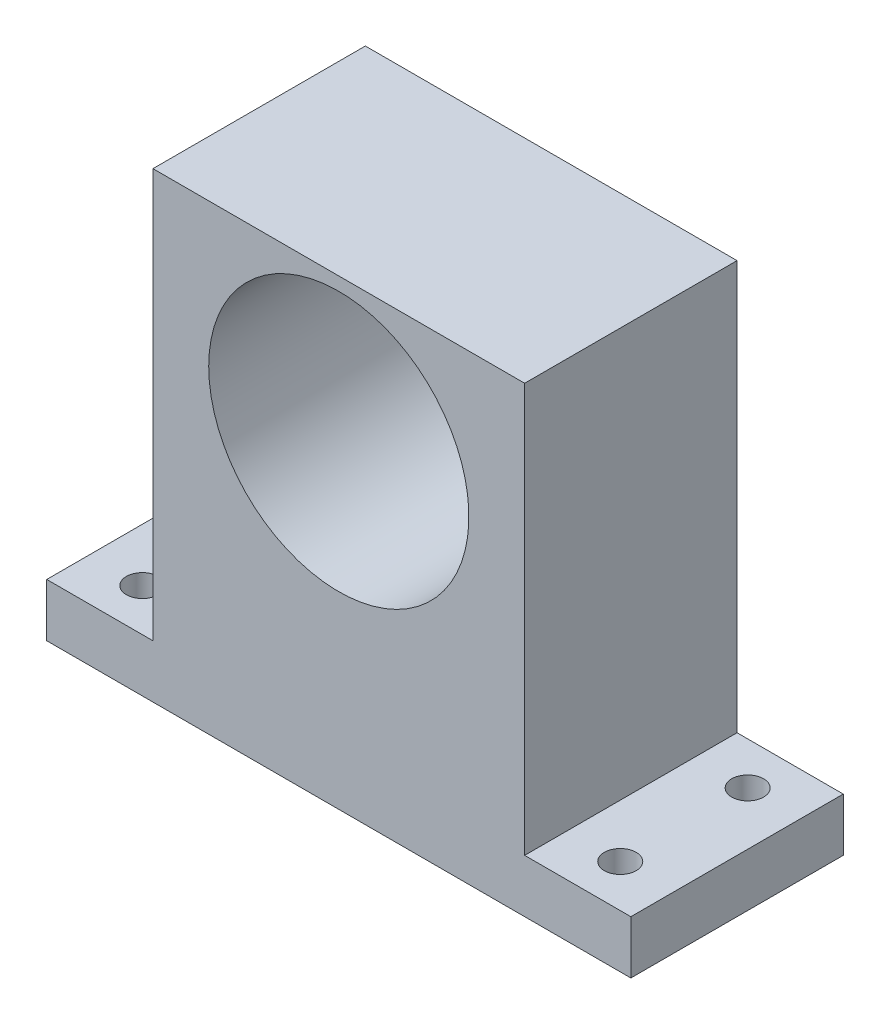
ISO-10303-21;
HEADER;
FILE_DESCRIPTION(('STEP AP214'),'2;1');
FILE_NAME('part.step','',(''),(''),'','','');
FILE_SCHEMA(('AUTOMOTIVE_DESIGN { 1 0 10303 214 1 1 1 1 }'));
ENDSEC;
DATA;
#1=APPLICATION_CONTEXT('core data for automotive mechanical design processes');
#2=APPLICATION_PROTOCOL_DEFINITION('international standard','automotive_design',2000,#1);
#3=PRODUCT_CONTEXT('',#1,'mechanical');
#4=PRODUCT('Part','Part','',(#3));
#5=PRODUCT_RELATED_PRODUCT_CATEGORY('part','',(#4));
#6=PRODUCT_DEFINITION_FORMATION('','',#4);
#7=PRODUCT_DEFINITION_CONTEXT('part definition',#1,'design');
#8=PRODUCT_DEFINITION('design','',#6,#7);
#9=PRODUCT_DEFINITION_SHAPE('','',#8);
#10=(LENGTH_UNIT() NAMED_UNIT(*) SI_UNIT(.MILLI.,.METRE.));
#11=(NAMED_UNIT(*) PLANE_ANGLE_UNIT() SI_UNIT($,.RADIAN.));
#12=(NAMED_UNIT(*) SI_UNIT($,.STERADIAN.) SOLID_ANGLE_UNIT());
#13=UNCERTAINTY_MEASURE_WITH_UNIT(LENGTH_MEASURE(1.E-05),#10,'distance_accuracy_value','');
#14=(GEOMETRIC_REPRESENTATION_CONTEXT(3) GLOBAL_UNCERTAINTY_ASSIGNED_CONTEXT((#13)) GLOBAL_UNIT_ASSIGNED_CONTEXT((#10,
#11,#12)) REPRESENTATION_CONTEXT('',''));
#15=CARTESIAN_POINT('',(0.,0.,0.));
#16=DIRECTION('',(0.,0.,1.));
#17=DIRECTION('',(1.,0.,0.));
#18=AXIS2_PLACEMENT_3D('',#15,#16,#17);
#19=CARTESIAN_POINT('',(-17.5,-21.75,20.));
#20=DIRECTION('',(1.,0.,0.));
#21=DIRECTION('',(0.,0.,-1.));
#22=AXIS2_PLACEMENT_3D('',#19,#20,#21);
#23=PLANE('',#22);
#24=DIRECTION('',(0.,0.,-1.));
#25=VECTOR('',#24,1.);
#26=CARTESIAN_POINT('',(-17.5,-16.75,0.));
#27=LINE('',#26,#25);
#28=CARTESIAN_POINT('',(-17.5,-16.75,20.));
#29=VERTEX_POINT('',#28);
#30=CARTESIAN_POINT('',(-17.5,-16.75,0.));
#31=VERTEX_POINT('',#30);
#32=EDGE_CURVE('E48',#29,#31,#27,.T.);
#33=ORIENTED_EDGE('',*,*,#32,.F.);
#34=DIRECTION('',(0.,-1.,0.));
#35=VECTOR('',#34,1.);
#36=CARTESIAN_POINT('',(-17.5,-21.75,20.));
#37=LINE('',#36,#35);
#38=CARTESIAN_POINT('',(-17.5,21.75,20.));
#39=VERTEX_POINT('',#38);
#40=EDGE_CURVE('E158',#39,#29,#37,.T.);
#41=ORIENTED_EDGE('',*,*,#40,.F.);
#42=DIRECTION('',(0.,0.,-1.));
#43=VECTOR('',#42,1.);
#44=CARTESIAN_POINT('',(-17.5,21.75,20.));
#45=LINE('',#44,#43);
#46=CARTESIAN_POINT('',(-17.5,21.75,0.));
#47=VERTEX_POINT('',#46);
#48=EDGE_CURVE('E41',#39,#47,#45,.T.);
#49=ORIENTED_EDGE('',*,*,#48,.T.);
#50=DIRECTION('',(0.,-1.,0.));
#51=VECTOR('',#50,1.);
#52=CARTESIAN_POINT('',(-17.5,-21.75,0.));
#53=LINE('',#52,#51);
#54=EDGE_CURVE('E111',#47,#31,#53,.T.);
#55=ORIENTED_EDGE('',*,*,#54,.T.);
#56=EDGE_LOOP('',(#33,#41,#49,#55));
#57=FACE_BOUND('',#56,.T.);
#58=ADVANCED_FACE('F33',(#57),#23,.F.);
#59=CARTESIAN_POINT('',(17.5,-21.75,20.));
#60=DIRECTION('',(-1.,0.,0.));
#61=DIRECTION('',(0.,0.,1.));
#62=AXIS2_PLACEMENT_3D('',#59,#60,#61);
#63=PLANE('',#62);
#64=DIRECTION('',(0.,0.,1.));
#65=VECTOR('',#64,1.);
#66=CARTESIAN_POINT('',(17.5,-16.75,20.));
#67=LINE('',#66,#65);
#68=CARTESIAN_POINT('',(17.5,-16.75,0.));
#69=VERTEX_POINT('',#68);
#70=CARTESIAN_POINT('',(17.5,-16.75,20.));
#71=VERTEX_POINT('',#70);
#72=EDGE_CURVE('E56',#69,#71,#67,.T.);
#73=ORIENTED_EDGE('',*,*,#72,.F.);
#74=DIRECTION('',(0.,1.,0.));
#75=VECTOR('',#74,1.);
#76=CARTESIAN_POINT('',(17.5,-21.75,0.));
#77=LINE('',#76,#75);
#78=CARTESIAN_POINT('',(17.5,21.75,0.));
#79=VERTEX_POINT('',#78);
#80=EDGE_CURVE('E154',#69,#79,#77,.T.);
#81=ORIENTED_EDGE('',*,*,#80,.T.);
#82=DIRECTION('',(0.,0.,-1.));
#83=VECTOR('',#82,1.);
#84=CARTESIAN_POINT('',(17.5,21.75,20.));
#85=LINE('',#84,#83);
#86=CARTESIAN_POINT('',(17.5,21.75,20.));
#87=VERTEX_POINT('',#86);
#88=EDGE_CURVE('E11',#87,#79,#85,.T.);
#89=ORIENTED_EDGE('',*,*,#88,.F.);
#90=DIRECTION('',(0.,1.,0.));
#91=VECTOR('',#90,1.);
#92=CARTESIAN_POINT('',(17.5,-21.75,20.));
#93=LINE('',#92,#91);
#94=EDGE_CURVE('E110',#71,#87,#93,.T.);
#95=ORIENTED_EDGE('',*,*,#94,.F.);
#96=EDGE_LOOP('',(#73,#81,#89,#95));
#97=FACE_BOUND('',#96,.T.);
#98=ADVANCED_FACE('F35',(#97),#63,.F.);
#99=CARTESIAN_POINT('',(-17.5,21.75,20.));
#100=DIRECTION('',(0.,-1.,0.));
#101=DIRECTION('',(0.,0.,-1.));
#102=AXIS2_PLACEMENT_3D('',#99,#100,#101);
#103=PLANE('',#102);
#104=DIRECTION('',(-1.,0.,0.));
#105=VECTOR('',#104,1.);
#106=CARTESIAN_POINT('',(-17.5,21.75,0.));
#107=LINE('',#106,#105);
#108=EDGE_CURVE('E162',#79,#47,#107,.T.);
#109=ORIENTED_EDGE('',*,*,#108,.T.);
#110=ORIENTED_EDGE('',*,*,#48,.F.);
#111=DIRECTION('',(-1.,0.,0.));
#112=VECTOR('',#111,1.);
#113=CARTESIAN_POINT('',(-17.5,21.75,20.));
#114=LINE('',#113,#112);
#115=EDGE_CURVE('E156',#87,#39,#114,.T.);
#116=ORIENTED_EDGE('',*,*,#115,.F.);
#117=ORIENTED_EDGE('',*,*,#88,.T.);
#118=EDGE_LOOP('',(#109,#110,#116,#117));
#119=FACE_BOUND('',#118,.T.);
#120=ADVANCED_FACE('F176',(#119),#103,.F.);
#121=CARTESIAN_POINT('',(-17.5,-21.75,20.));
#122=DIRECTION('',(0.,1.,0.));
#123=DIRECTION('',(0.,0.,1.));
#124=AXIS2_PLACEMENT_3D('',#121,#122,#123);
#125=PLANE('',#124);
#126=CARTESIAN_POINT('',(-22.5,-21.75,4.));
#127=DIRECTION('',(0.,1.,0.));
#128=DIRECTION('',(0.,0.,1.));
#129=AXIS2_PLACEMENT_3D('',#126,#127,#128);
#130=CIRCLE('',#129,1.5);
#131=CARTESIAN_POINT('',(-22.5,-21.75,5.5));
#132=VERTEX_POINT('',#131);
#133=EDGE_CURVE('E214',#132,#132,#130,.T.);
#134=ORIENTED_EDGE('',*,*,#133,.T.);
#135=EDGE_LOOP('',(#134));
#136=FACE_BOUND('',#135,.T.);
#137=CARTESIAN_POINT('',(22.5,-21.75,16.));
#138=DIRECTION('',(0.,1.,0.));
#139=DIRECTION('',(0.,0.,1.));
#140=AXIS2_PLACEMENT_3D('',#137,#138,#139);
#141=CIRCLE('',#140,1.5);
#142=CARTESIAN_POINT('',(22.5,-21.75,17.5));
#143=VERTEX_POINT('',#142);
#144=EDGE_CURVE('E218',#143,#143,#141,.T.);
#145=ORIENTED_EDGE('',*,*,#144,.T.);
#146=EDGE_LOOP('',(#145));
#147=FACE_BOUND('',#146,.T.);
#148=CARTESIAN_POINT('',(22.5,-21.75,4.));
#149=DIRECTION('',(0.,1.,0.));
#150=DIRECTION('',(0.,0.,1.));
#151=AXIS2_PLACEMENT_3D('',#148,#149,#150);
#152=CIRCLE('',#151,1.5);
#153=CARTESIAN_POINT('',(22.5,-21.75,5.5));
#154=VERTEX_POINT('',#153);
#155=EDGE_CURVE('E222',#154,#154,#152,.T.);
#156=ORIENTED_EDGE('',*,*,#155,.T.);
#157=EDGE_LOOP('',(#156));
#158=FACE_BOUND('',#157,.T.);
#159=CARTESIAN_POINT('',(-22.5,-21.75,16.));
#160=DIRECTION('',(0.,1.,0.));
#161=DIRECTION('',(0.,0.,1.));
#162=AXIS2_PLACEMENT_3D('',#159,#160,#161);
#163=CIRCLE('',#162,1.5);
#164=CARTESIAN_POINT('',(-22.5,-21.75,17.5));
#165=VERTEX_POINT('',#164);
#166=EDGE_CURVE('E126',#165,#165,#163,.T.);
#167=ORIENTED_EDGE('',*,*,#166,.T.);
#168=EDGE_LOOP('',(#167));
#169=FACE_BOUND('',#168,.T.);
#170=DIRECTION('',(1.,0.,0.));
#171=VECTOR('',#170,1.);
#172=CARTESIAN_POINT('',(-17.5,-21.75,0.));
#173=LINE('',#172,#171);
#174=CARTESIAN_POINT('',(-27.5,-21.75,0.));
#175=VERTEX_POINT('',#174);
#176=CARTESIAN_POINT('',(27.5,-21.75,0.));
#177=VERTEX_POINT('',#176);
#178=EDGE_CURVE('E99',#175,#177,#173,.T.);
#179=ORIENTED_EDGE('',*,*,#178,.T.);
#180=DIRECTION('',(0.,0.,-1.));
#181=VECTOR('',#180,1.);
#182=CARTESIAN_POINT('',(27.5,-21.75,20.));
#183=LINE('',#182,#181);
#184=CARTESIAN_POINT('',(27.5,-21.75,20.));
#185=VERTEX_POINT('',#184);
#186=EDGE_CURVE('E142',#185,#177,#183,.T.);
#187=ORIENTED_EDGE('',*,*,#186,.F.);
#188=DIRECTION('',(1.,0.,0.));
#189=VECTOR('',#188,1.);
#190=CARTESIAN_POINT('',(-17.5,-21.75,20.));
#191=LINE('',#190,#189);
#192=CARTESIAN_POINT('',(-27.5,-21.75,20.));
#193=VERTEX_POINT('',#192);
#194=EDGE_CURVE('E116',#193,#185,#191,.T.);
#195=ORIENTED_EDGE('',*,*,#194,.F.);
#196=DIRECTION('',(0.,0.,1.));
#197=VECTOR('',#196,1.);
#198=CARTESIAN_POINT('',(-27.5,-21.75,0.));
#199=LINE('',#198,#197);
#200=EDGE_CURVE('E114',#175,#193,#199,.T.);
#201=ORIENTED_EDGE('',*,*,#200,.F.);
#202=EDGE_LOOP('',(#179,#187,#195,#201));
#203=FACE_BOUND('',#202,.T.);
#204=ADVANCED_FACE('F115',(#136,#147,#158,#169,#203),#125,.F.);
#205=CARTESIAN_POINT('',(0.,0.,20.));
#206=DIRECTION('',(0.,0.,-1.));
#207=DIRECTION('',(-1.,0.,0.));
#208=AXIS2_PLACEMENT_3D('',#205,#206,#207);
#209=PLANE('',#208);
#210=CARTESIAN_POINT('',(0.,8.25,20.));
#211=DIRECTION('',(0.,0.,-1.));
#212=DIRECTION('',(-1.,0.,0.));
#213=AXIS2_PLACEMENT_3D('',#210,#211,#212);
#214=CIRCLE('',#213,12.25);
#215=CARTESIAN_POINT('',(-12.25,8.25,20.));
#216=VERTEX_POINT('',#215);
#217=EDGE_CURVE('E239',#216,#216,#214,.T.);
#218=ORIENTED_EDGE('',*,*,#217,.T.);
#219=EDGE_LOOP('',(#218));
#220=FACE_BOUND('',#219,.T.);
#221=ORIENTED_EDGE('',*,*,#194,.T.);
#222=DIRECTION('',(0.,-1.,0.));
#223=VECTOR('',#222,1.);
#224=CARTESIAN_POINT('',(27.5,-21.75,20.));
#225=LINE('',#224,#223);
#226=CARTESIAN_POINT('',(27.5,-16.75,20.));
#227=VERTEX_POINT('',#226);
#228=EDGE_CURVE('E139',#227,#185,#225,.T.);
#229=ORIENTED_EDGE('',*,*,#228,.F.);
#230=DIRECTION('',(-1.,0.,0.));
#231=VECTOR('',#230,1.);
#232=CARTESIAN_POINT('',(27.5,-16.75,20.));
#233=LINE('',#232,#231);
#234=EDGE_CURVE('E147',#227,#71,#233,.T.);
#235=ORIENTED_EDGE('',*,*,#234,.T.);
#236=ORIENTED_EDGE('',*,*,#94,.T.);
#237=ORIENTED_EDGE('',*,*,#115,.T.);
#238=ORIENTED_EDGE('',*,*,#40,.T.);
#239=DIRECTION('',(1.,0.,0.));
#240=VECTOR('',#239,1.);
#241=CARTESIAN_POINT('',(-27.5,-16.75,20.));
#242=LINE('',#241,#240);
#243=CARTESIAN_POINT('',(-27.5,-16.75,20.));
#244=VERTEX_POINT('',#243);
#245=EDGE_CURVE('E136',#244,#29,#242,.T.);
#246=ORIENTED_EDGE('',*,*,#245,.F.);
#247=DIRECTION('',(0.,1.,0.));
#248=VECTOR('',#247,1.);
#249=CARTESIAN_POINT('',(-27.5,-21.75,20.));
#250=LINE('',#249,#248);
#251=EDGE_CURVE('E119',#193,#244,#250,.T.);
#252=ORIENTED_EDGE('',*,*,#251,.F.);
#253=EDGE_LOOP('',(#221,#229,#235,#236,#237,#238,#246,#252));
#254=FACE_BOUND('',#253,.T.);
#255=ADVANCED_FACE('F174',(#220,#254),#209,.F.);
#256=CARTESIAN_POINT('',(0.,0.,0.));
#257=DIRECTION('',(0.,0.,-1.));
#258=DIRECTION('',(-1.,0.,0.));
#259=AXIS2_PLACEMENT_3D('',#256,#257,#258);
#260=PLANE('',#259);
#261=CARTESIAN_POINT('',(0.,8.25,0.));
#262=DIRECTION('',(0.,0.,-1.));
#263=DIRECTION('',(-1.,0.,0.));
#264=AXIS2_PLACEMENT_3D('',#261,#262,#263);
#265=CIRCLE('',#264,12.25);
#266=CARTESIAN_POINT('',(-12.25,8.25,0.));
#267=VERTEX_POINT('',#266);
#268=EDGE_CURVE('E241',#267,#267,#265,.T.);
#269=ORIENTED_EDGE('',*,*,#268,.F.);
#270=EDGE_LOOP('',(#269));
#271=FACE_BOUND('',#270,.T.);
#272=ORIENTED_EDGE('',*,*,#80,.F.);
#273=DIRECTION('',(-1.,0.,0.));
#274=VECTOR('',#273,1.);
#275=CARTESIAN_POINT('',(27.5,-16.75,0.));
#276=LINE('',#275,#274);
#277=CARTESIAN_POINT('',(27.5,-16.75,0.));
#278=VERTEX_POINT('',#277);
#279=EDGE_CURVE('E151',#278,#69,#276,.T.);
#280=ORIENTED_EDGE('',*,*,#279,.F.);
#281=DIRECTION('',(0.,1.,0.));
#282=VECTOR('',#281,1.);
#283=CARTESIAN_POINT('',(27.5,-21.75,0.));
#284=LINE('',#283,#282);
#285=EDGE_CURVE('E106',#177,#278,#284,.T.);
#286=ORIENTED_EDGE('',*,*,#285,.F.);
#287=ORIENTED_EDGE('',*,*,#178,.F.);
#288=DIRECTION('',(0.,-1.,0.));
#289=VECTOR('',#288,1.);
#290=CARTESIAN_POINT('',(-27.5,-21.75,0.));
#291=LINE('',#290,#289);
#292=CARTESIAN_POINT('',(-27.5,-16.75,0.));
#293=VERTEX_POINT('',#292);
#294=EDGE_CURVE('E104',#293,#175,#291,.T.);
#295=ORIENTED_EDGE('',*,*,#294,.F.);
#296=DIRECTION('',(1.,0.,0.));
#297=VECTOR('',#296,1.);
#298=CARTESIAN_POINT('',(-27.5,-16.75,0.));
#299=LINE('',#298,#297);
#300=EDGE_CURVE('E133',#293,#31,#299,.T.);
#301=ORIENTED_EDGE('',*,*,#300,.T.);
#302=ORIENTED_EDGE('',*,*,#54,.F.);
#303=ORIENTED_EDGE('',*,*,#108,.F.);
#304=EDGE_LOOP('',(#272,#280,#286,#287,#295,#301,#302,#303));
#305=FACE_BOUND('',#304,.T.);
#306=ADVANCED_FACE('F101',(#271,#305),#260,.T.);
#307=CARTESIAN_POINT('',(27.5,-16.75,20.));
#308=DIRECTION('',(0.,-1.,0.));
#309=DIRECTION('',(0.,0.,-1.));
#310=AXIS2_PLACEMENT_3D('',#307,#308,#309);
#311=PLANE('',#310);
#312=CARTESIAN_POINT('',(22.5,-16.75,16.));
#313=DIRECTION('',(0.,1.,0.));
#314=DIRECTION('',(0.,0.,1.));
#315=AXIS2_PLACEMENT_3D('',#312,#313,#314);
#316=CIRCLE('',#315,1.5);
#317=CARTESIAN_POINT('',(22.5,-16.75,17.5));
#318=VERTEX_POINT('',#317);
#319=EDGE_CURVE('E228',#318,#318,#316,.T.);
#320=ORIENTED_EDGE('',*,*,#319,.F.);
#321=EDGE_LOOP('',(#320));
#322=FACE_BOUND('',#321,.T.);
#323=CARTESIAN_POINT('',(22.5,-16.75,4.));
#324=DIRECTION('',(0.,1.,0.));
#325=DIRECTION('',(0.,0.,1.));
#326=AXIS2_PLACEMENT_3D('',#323,#324,#325);
#327=CIRCLE('',#326,1.5);
#328=CARTESIAN_POINT('',(22.5,-16.75,5.5));
#329=VERTEX_POINT('',#328);
#330=EDGE_CURVE('E236',#329,#329,#327,.T.);
#331=ORIENTED_EDGE('',*,*,#330,.F.);
#332=EDGE_LOOP('',(#331));
#333=FACE_BOUND('',#332,.T.);
#334=ORIENTED_EDGE('',*,*,#72,.T.);
#335=ORIENTED_EDGE('',*,*,#234,.F.);
#336=DIRECTION('',(0.,0.,1.));
#337=VECTOR('',#336,1.);
#338=CARTESIAN_POINT('',(27.5,-16.75,20.));
#339=LINE('',#338,#337);
#340=EDGE_CURVE('E145',#278,#227,#339,.T.);
#341=ORIENTED_EDGE('',*,*,#340,.F.);
#342=ORIENTED_EDGE('',*,*,#279,.T.);
#343=EDGE_LOOP('',(#334,#335,#341,#342));
#344=FACE_BOUND('',#343,.T.);
#345=ADVANCED_FACE('F179',(#322,#333,#344),#311,.F.);
#346=CARTESIAN_POINT('',(27.5,0.,0.));
#347=DIRECTION('',(-1.,0.,0.));
#348=DIRECTION('',(0.,0.,1.));
#349=AXIS2_PLACEMENT_3D('',#346,#347,#348);
#350=PLANE('',#349);
#351=ORIENTED_EDGE('',*,*,#228,.T.);
#352=ORIENTED_EDGE('',*,*,#186,.T.);
#353=ORIENTED_EDGE('',*,*,#285,.T.);
#354=ORIENTED_EDGE('',*,*,#340,.T.);
#355=EDGE_LOOP('',(#351,#352,#353,#354));
#356=FACE_BOUND('',#355,.T.);
#357=ADVANCED_FACE('F183',(#356),#350,.F.);
#358=CARTESIAN_POINT('',(-27.5,-16.75,0.));
#359=DIRECTION('',(0.,-1.,0.));
#360=DIRECTION('',(0.,0.,-1.));
#361=AXIS2_PLACEMENT_3D('',#358,#359,#360);
#362=PLANE('',#361);
#363=CARTESIAN_POINT('',(-22.5,-16.75,4.));
#364=DIRECTION('',(0.,1.,0.));
#365=DIRECTION('',(0.,0.,1.));
#366=AXIS2_PLACEMENT_3D('',#363,#364,#365);
#367=CIRCLE('',#366,1.5);
#368=CARTESIAN_POINT('',(-22.5,-16.75,5.5));
#369=VERTEX_POINT('',#368);
#370=EDGE_CURVE('E232',#369,#369,#367,.T.);
#371=ORIENTED_EDGE('',*,*,#370,.F.);
#372=EDGE_LOOP('',(#371));
#373=FACE_BOUND('',#372,.T.);
#374=CARTESIAN_POINT('',(-22.5,-16.75,16.));
#375=DIRECTION('',(0.,1.,0.));
#376=DIRECTION('',(0.,0.,1.));
#377=AXIS2_PLACEMENT_3D('',#374,#375,#376);
#378=CIRCLE('',#377,1.5);
#379=CARTESIAN_POINT('',(-22.5,-16.75,17.5));
#380=VERTEX_POINT('',#379);
#381=EDGE_CURVE('E129',#380,#380,#378,.T.);
#382=ORIENTED_EDGE('',*,*,#381,.F.);
#383=EDGE_LOOP('',(#382));
#384=FACE_BOUND('',#383,.T.);
#385=ORIENTED_EDGE('',*,*,#32,.T.);
#386=ORIENTED_EDGE('',*,*,#300,.F.);
#387=DIRECTION('',(0.,0.,-1.));
#388=VECTOR('',#387,1.);
#389=CARTESIAN_POINT('',(-27.5,-16.75,0.));
#390=LINE('',#389,#388);
#391=EDGE_CURVE('E123',#244,#293,#390,.T.);
#392=ORIENTED_EDGE('',*,*,#391,.F.);
#393=ORIENTED_EDGE('',*,*,#245,.T.);
#394=EDGE_LOOP('',(#385,#386,#392,#393));
#395=FACE_BOUND('',#394,.T.);
#396=ADVANCED_FACE('F171',(#373,#384,#395),#362,.F.);
#397=CARTESIAN_POINT('',(-27.5,0.,0.));
#398=DIRECTION('',(1.,0.,0.));
#399=DIRECTION('',(0.,0.,-1.));
#400=AXIS2_PLACEMENT_3D('',#397,#398,#399);
#401=PLANE('',#400);
#402=ORIENTED_EDGE('',*,*,#294,.T.);
#403=ORIENTED_EDGE('',*,*,#200,.T.);
#404=ORIENTED_EDGE('',*,*,#251,.T.);
#405=ORIENTED_EDGE('',*,*,#391,.T.);
#406=EDGE_LOOP('',(#402,#403,#404,#405));
#407=FACE_BOUND('',#406,.T.);
#408=ADVANCED_FACE('F121',(#407),#401,.F.);
#409=CARTESIAN_POINT('',(-22.5,-21.75,16.));
#410=DIRECTION('',(0.,1.,0.));
#411=DIRECTION('',(0.,0.,1.));
#412=AXIS2_PLACEMENT_3D('',#409,#410,#411);
#413=CYLINDRICAL_SURFACE('',#412,1.5);
#414=ORIENTED_EDGE('',*,*,#166,.F.);
#415=EDGE_LOOP('',(#414));
#416=FACE_BOUND('',#415,.T.);
#417=ORIENTED_EDGE('',*,*,#381,.T.);
#418=EDGE_LOOP('',(#417));
#419=FACE_BOUND('',#418,.T.);
#420=ADVANCED_FACE('F282',(#416,#419),#413,.F.);
#421=CARTESIAN_POINT('',(-22.5,-21.75,4.));
#422=DIRECTION('',(0.,1.,0.));
#423=DIRECTION('',(0.,0.,1.));
#424=AXIS2_PLACEMENT_3D('',#421,#422,#423);
#425=CYLINDRICAL_SURFACE('',#424,1.5);
#426=ORIENTED_EDGE('',*,*,#133,.F.);
#427=EDGE_LOOP('',(#426));
#428=FACE_BOUND('',#427,.T.);
#429=ORIENTED_EDGE('',*,*,#370,.T.);
#430=EDGE_LOOP('',(#429));
#431=FACE_BOUND('',#430,.T.);
#432=ADVANCED_FACE('F287',(#428,#431),#425,.F.);
#433=CARTESIAN_POINT('',(22.5,-21.75,4.));
#434=DIRECTION('',(0.,1.,0.));
#435=DIRECTION('',(0.,0.,1.));
#436=AXIS2_PLACEMENT_3D('',#433,#434,#435);
#437=CYLINDRICAL_SURFACE('',#436,1.5);
#438=ORIENTED_EDGE('',*,*,#155,.F.);
#439=EDGE_LOOP('',(#438));
#440=FACE_BOUND('',#439,.T.);
#441=ORIENTED_EDGE('',*,*,#330,.T.);
#442=EDGE_LOOP('',(#441));
#443=FACE_BOUND('',#442,.T.);
#444=ADVANCED_FACE('F296',(#440,#443),#437,.F.);
#445=CARTESIAN_POINT('',(22.5,-21.75,16.));
#446=DIRECTION('',(0.,1.,0.));
#447=DIRECTION('',(0.,0.,1.));
#448=AXIS2_PLACEMENT_3D('',#445,#446,#447);
#449=CYLINDRICAL_SURFACE('',#448,1.5);
#450=ORIENTED_EDGE('',*,*,#144,.F.);
#451=EDGE_LOOP('',(#450));
#452=FACE_BOUND('',#451,.T.);
#453=ORIENTED_EDGE('',*,*,#319,.T.);
#454=EDGE_LOOP('',(#453));
#455=FACE_BOUND('',#454,.T.);
#456=ADVANCED_FACE('F250',(#452,#455),#449,.F.);
#457=CARTESIAN_POINT('',(0.,8.25,20.));
#458=DIRECTION('',(0.,0.,-1.));
#459=DIRECTION('',(-1.,0.,0.));
#460=AXIS2_PLACEMENT_3D('',#457,#458,#459);
#461=CYLINDRICAL_SURFACE('',#460,12.25);
#462=ORIENTED_EDGE('',*,*,#217,.F.);
#463=EDGE_LOOP('',(#462));
#464=FACE_BOUND('',#463,.T.);
#465=ORIENTED_EDGE('',*,*,#268,.T.);
#466=EDGE_LOOP('',(#465));
#467=FACE_BOUND('',#466,.T.);
#468=ADVANCED_FACE('F247',(#464,#467),#461,.F.);
#469=CLOSED_SHELL('',(#58,#98,#120,#204,#255,#306,#345,#357,#396,#408,#420,#432,#444,#456,#468));
#470=MANIFOLD_SOLID_BREP('B2',#469);
#471=ADVANCED_BREP_SHAPE_REPRESENTATION('',(#18,#470),#14);
#472=SHAPE_DEFINITION_REPRESENTATION(#9,#471);
ENDSEC;
END-ISO-10303-21;
